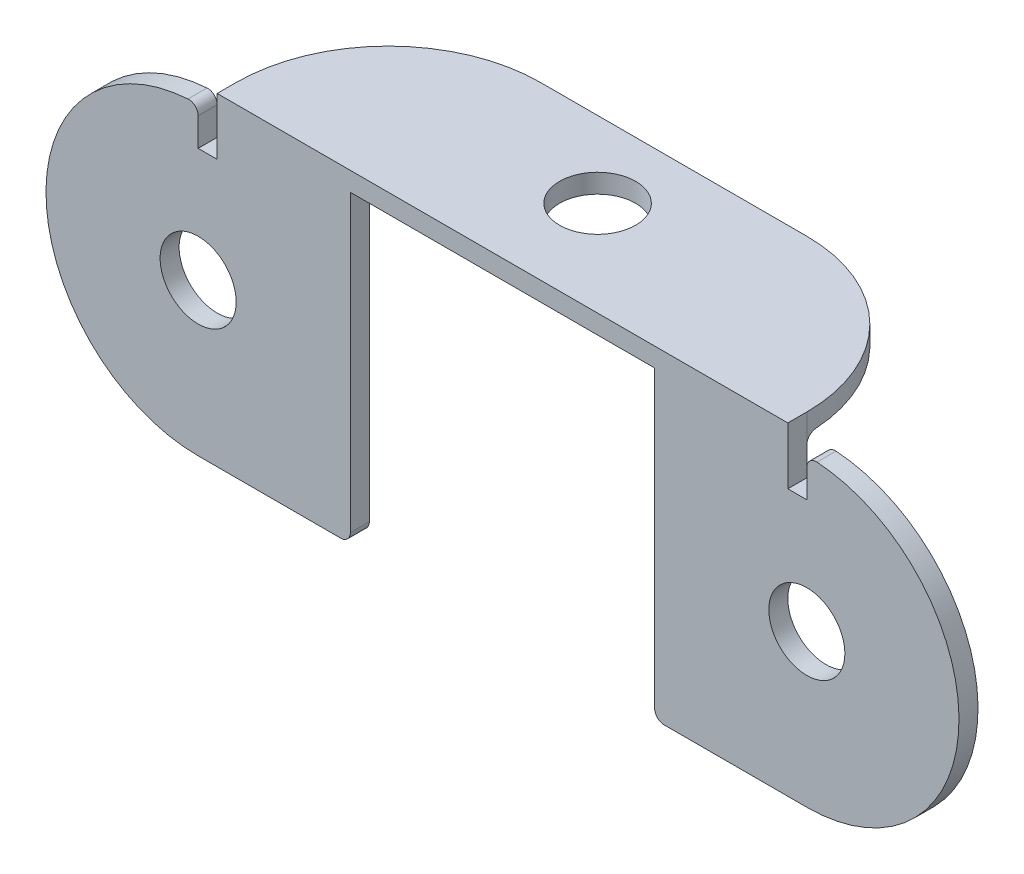
ISO-10303-21;
HEADER;
FILE_DESCRIPTION(('STEP AP214'),'2;1');
FILE_NAME('part.step','',(''),(''),'','','');
FILE_SCHEMA(('AUTOMOTIVE_DESIGN { 1 0 10303 214 1 1 1 1 }'));
ENDSEC;
DATA;
#1=APPLICATION_CONTEXT('core data for automotive mechanical design processes');
#2=APPLICATION_PROTOCOL_DEFINITION('international standard','automotive_design',2000,#1);
#3=PRODUCT_CONTEXT('',#1,'mechanical');
#4=PRODUCT('Part','Part','',(#3));
#5=PRODUCT_RELATED_PRODUCT_CATEGORY('part','',(#4));
#6=PRODUCT_DEFINITION_FORMATION('','',#4);
#7=PRODUCT_DEFINITION_CONTEXT('part definition',#1,'design');
#8=PRODUCT_DEFINITION('design','',#6,#7);
#9=PRODUCT_DEFINITION_SHAPE('','',#8);
#10=(LENGTH_UNIT() NAMED_UNIT(*) SI_UNIT(.MILLI.,.METRE.));
#11=(NAMED_UNIT(*) PLANE_ANGLE_UNIT() SI_UNIT($,.RADIAN.));
#12=(NAMED_UNIT(*) SI_UNIT($,.STERADIAN.) SOLID_ANGLE_UNIT());
#13=UNCERTAINTY_MEASURE_WITH_UNIT(LENGTH_MEASURE(1.E-05),#10,'distance_accuracy_value','');
#14=(GEOMETRIC_REPRESENTATION_CONTEXT(3) GLOBAL_UNCERTAINTY_ASSIGNED_CONTEXT((#13)) GLOBAL_UNIT_ASSIGNED_CONTEXT((#10,
#11,#12)) REPRESENTATION_CONTEXT('',''));
#15=CARTESIAN_POINT('',(0.,0.,0.));
#16=DIRECTION('',(0.,0.,1.));
#17=DIRECTION('',(1.,0.,0.));
#18=AXIS2_PLACEMENT_3D('',#15,#16,#17);
#19=CARTESIAN_POINT('',(0.,0.,0.));
#20=DIRECTION('',(0.,0.,1.));
#21=DIRECTION('',(1.,0.,0.));
#22=AXIS2_PLACEMENT_3D('',#19,#20,#21);
#23=PLANE('',#22);
#24=DIRECTION('',(0.,1.,0.));
#25=VECTOR('',#24,1.);
#26=CARTESIAN_POINT('',(-12.7,0.,0.));
#27=LINE('',#26,#25);
#28=CARTESIAN_POINT('',(-12.7,-11.90625,0.));
#29=VERTEX_POINT('',#28);
#30=CARTESIAN_POINT('',(-12.7,11.90625,0.));
#31=VERTEX_POINT('',#30);
#32=EDGE_CURVE('E281',#29,#31,#27,.T.);
#33=ORIENTED_EDGE('',*,*,#32,.F.);
#34=CARTESIAN_POINT('',(-13.49375,-11.90625,0.));
#35=DIRECTION('',(0.,0.,1.));
#36=DIRECTION('',(1.,0.,0.));
#37=AXIS2_PLACEMENT_3D('',#34,#35,#36);
#38=CIRCLE('',#37,0.79375);
#39=CARTESIAN_POINT('',(-13.49375,-12.7,0.));
#40=VERTEX_POINT('',#39);
#41=EDGE_CURVE('E355',#29,#40,#38,.F.);
#42=ORIENTED_EDGE('',*,*,#41,.T.);
#43=DIRECTION('',(1.,0.,0.));
#44=VECTOR('',#43,1.);
#45=CARTESIAN_POINT('',(0.,-12.7,0.));
#46=LINE('',#45,#44);
#47=CARTESIAN_POINT('',(-25.4,-12.7,0.));
#48=VERTEX_POINT('',#47);
#49=EDGE_CURVE('E277',#48,#40,#46,.T.);
#50=ORIENTED_EDGE('',*,*,#49,.F.);
#51=CARTESIAN_POINT('',(-25.4,0.,0.));
#52=DIRECTION('',(0.,0.,1.));
#53=DIRECTION('',(1.,0.,0.));
#54=AXIS2_PLACEMENT_3D('',#51,#52,#53);
#55=CIRCLE('',#54,12.7);
#56=CARTESIAN_POINT('',(-26.2466666666667,12.6717463498744,0.));
#57=VERTEX_POINT('',#56);
#58=EDGE_CURVE('E274',#57,#48,#55,.T.);
#59=ORIENTED_EDGE('',*,*,#58,.F.);
#60=CARTESIAN_POINT('',(-26.19375,11.8797622030073,0.));
#61=DIRECTION('',(0.,0.,1.));
#62=DIRECTION('',(1.,0.,0.));
#63=AXIS2_PLACEMENT_3D('',#60,#61,#62);
#64=CIRCLE('',#63,0.79375);
#65=CARTESIAN_POINT('',(-25.4,11.8797622030073,0.));
#66=VERTEX_POINT('',#65);
#67=EDGE_CURVE('E352',#57,#66,#64,.F.);
#68=ORIENTED_EDGE('',*,*,#67,.T.);
#69=DIRECTION('',(0.,-1.,0.));
#70=VECTOR('',#69,1.);
#71=CARTESIAN_POINT('',(-25.4,0.,0.));
#72=LINE('',#71,#70);
#73=CARTESIAN_POINT('',(-25.4,9.525,0.));
#74=VERTEX_POINT('',#73);
#75=EDGE_CURVE('E539',#66,#74,#72,.T.);
#76=ORIENTED_EDGE('',*,*,#75,.T.);
#77=DIRECTION('',(1.,0.,0.));
#78=VECTOR('',#77,1.);
#79=CARTESIAN_POINT('',(0.,9.525,0.));
#80=LINE('',#79,#78);
#81=CARTESIAN_POINT('',(-23.8125,9.525,0.));
#82=VERTEX_POINT('',#81);
#83=EDGE_CURVE('E550',#74,#82,#80,.T.);
#84=ORIENTED_EDGE('',*,*,#83,.T.);
#85=DIRECTION('',(0.,1.,0.));
#86=VECTOR('',#85,1.);
#87=CARTESIAN_POINT('',(-23.8125,0.,0.));
#88=LINE('',#87,#86);
#89=CARTESIAN_POINT('',(-23.8125,11.90625,0.));
#90=VERTEX_POINT('',#89);
#91=EDGE_CURVE('E552',#82,#90,#88,.T.);
#92=ORIENTED_EDGE('',*,*,#91,.T.);
#93=DIRECTION('',(1.,0.,0.));
#94=VECTOR('',#93,1.);
#95=CARTESIAN_POINT('',(-12.7,11.90625,0.));
#96=LINE('',#95,#94);
#97=EDGE_CURVE('E348',#90,#31,#96,.T.);
#98=ORIENTED_EDGE('',*,*,#97,.T.);
#99=EDGE_LOOP('',(#33,#42,#50,#59,#68,#76,#84,#92,#98));
#100=FACE_BOUND('',#99,.T.);
#101=CARTESIAN_POINT('',(-25.4,0.,0.));
#102=DIRECTION('',(0.,0.,1.));
#103=DIRECTION('',(1.,0.,0.));
#104=AXIS2_PLACEMENT_3D('',#101,#102,#103);
#105=CIRCLE('',#104,3.175);
#106=CARTESIAN_POINT('',(-22.225,0.,0.));
#107=VERTEX_POINT('',#106);
#108=EDGE_CURVE('E285',#107,#107,#105,.T.);
#109=ORIENTED_EDGE('',*,*,#108,.T.);
#110=EDGE_LOOP('',(#109));
#111=FACE_BOUND('',#110,.T.);
#112=ADVANCED_FACE('F41',(#100,#111),#23,.F.);
#113=CARTESIAN_POINT('',(12.7,0.,1.5875));
#114=DIRECTION('',(-1.,0.,0.));
#115=DIRECTION('',(0.,0.,1.));
#116=AXIS2_PLACEMENT_3D('',#113,#114,#115);
#117=PLANE('',#116);
#118=DIRECTION('',(0.,1.,0.));
#119=VECTOR('',#118,1.);
#120=CARTESIAN_POINT('',(12.7,0.,0.));
#121=LINE('',#120,#119);
#122=CARTESIAN_POINT('',(12.7,-11.90625,0.));
#123=VERTEX_POINT('',#122);
#124=CARTESIAN_POINT('',(12.7,11.90625,0.));
#125=VERTEX_POINT('',#124);
#126=EDGE_CURVE('E262',#123,#125,#121,.T.);
#127=ORIENTED_EDGE('',*,*,#126,.F.);
#128=DIRECTION('',(0.,0.,-1.));
#129=VECTOR('',#128,1.);
#130=CARTESIAN_POINT('',(12.7,-11.90625,1.5875));
#131=LINE('',#130,#129);
#132=CARTESIAN_POINT('',(12.7,-11.90625,1.5875));
#133=VERTEX_POINT('',#132);
#134=EDGE_CURVE('E329',#123,#133,#131,.F.);
#135=ORIENTED_EDGE('',*,*,#134,.T.);
#136=DIRECTION('',(0.,1.,0.));
#137=VECTOR('',#136,1.);
#138=CARTESIAN_POINT('',(12.7,0.,1.5875));
#139=LINE('',#138,#137);
#140=CARTESIAN_POINT('',(12.7,12.7,1.5875));
#141=VERTEX_POINT('',#140);
#142=EDGE_CURVE('E293',#133,#141,#139,.T.);
#143=ORIENTED_EDGE('',*,*,#142,.T.);
#144=DIRECTION('',(0.,0.,-1.));
#145=VECTOR('',#144,1.);
#146=CARTESIAN_POINT('',(12.7,12.7,1.5875));
#147=LINE('',#146,#145);
#148=CARTESIAN_POINT('',(12.7,12.7,-0.79375));
#149=VERTEX_POINT('',#148);
#150=EDGE_CURVE('E261',#141,#149,#147,.T.);
#151=ORIENTED_EDGE('',*,*,#150,.T.);
#152=CARTESIAN_POINT('',(12.7,11.90625,-0.79375));
#153=DIRECTION('',(-1.,0.,0.));
#154=DIRECTION('',(0.,0.,1.));
#155=AXIS2_PLACEMENT_3D('',#152,#153,#154);
#156=CIRCLE('',#155,0.79375);
#157=EDGE_CURVE('E386',#149,#125,#156,.F.);
#158=ORIENTED_EDGE('',*,*,#157,.T.);
#159=EDGE_LOOP('',(#127,#135,#143,#151,#158));
#160=FACE_BOUND('',#159,.T.);
#161=ADVANCED_FACE('F439',(#160),#117,.T.);
#162=CARTESIAN_POINT('',(0.,-12.7,1.5875));
#163=DIRECTION('',(0.,1.,0.));
#164=DIRECTION('',(-1.,0.,0.));
#165=AXIS2_PLACEMENT_3D('',#162,#163,#164);
#166=PLANE('',#165);
#167=DIRECTION('',(1.,0.,0.));
#168=VECTOR('',#167,1.);
#169=CARTESIAN_POINT('',(0.,-12.7,1.5875));
#170=LINE('',#169,#168);
#171=CARTESIAN_POINT('',(13.49375,-12.7,1.5875));
#172=VERTEX_POINT('',#171);
#173=CARTESIAN_POINT('',(25.4,-12.7,1.5875));
#174=VERTEX_POINT('',#173);
#175=EDGE_CURVE('E239',#172,#174,#170,.T.);
#176=ORIENTED_EDGE('',*,*,#175,.F.);
#177=DIRECTION('',(0.,0.,-1.));
#178=VECTOR('',#177,1.);
#179=CARTESIAN_POINT('',(13.49375,-12.7,0.));
#180=LINE('',#179,#178);
#181=CARTESIAN_POINT('',(13.49375,-12.7,0.));
#182=VERTEX_POINT('',#181);
#183=EDGE_CURVE('E315',#172,#182,#180,.T.);
#184=ORIENTED_EDGE('',*,*,#183,.T.);
#185=DIRECTION('',(1.,0.,0.));
#186=VECTOR('',#185,1.);
#187=CARTESIAN_POINT('',(0.,-12.7,0.));
#188=LINE('',#187,#186);
#189=CARTESIAN_POINT('',(25.4,-12.7,0.));
#190=VERTEX_POINT('',#189);
#191=EDGE_CURVE('E266',#182,#190,#188,.T.);
#192=ORIENTED_EDGE('',*,*,#191,.T.);
#193=DIRECTION('',(0.,0.,-1.));
#194=VECTOR('',#193,1.);
#195=CARTESIAN_POINT('',(25.4,-12.7,1.5875));
#196=LINE('',#195,#194);
#197=EDGE_CURVE('E304',#174,#190,#196,.T.);
#198=ORIENTED_EDGE('',*,*,#197,.F.);
#199=EDGE_LOOP('',(#176,#184,#192,#198));
#200=FACE_BOUND('',#199,.T.);
#201=ADVANCED_FACE('F442',(#200),#166,.F.);
#202=CARTESIAN_POINT('',(25.4,0.,1.5875));
#203=DIRECTION('',(0.,0.,-1.));
#204=DIRECTION('',(-1.,0.,0.));
#205=AXIS2_PLACEMENT_3D('',#202,#203,#204);
#206=CYLINDRICAL_SURFACE('',#205,12.7);
#207=CARTESIAN_POINT('',(25.4,0.,0.));
#208=DIRECTION('',(0.,0.,1.));
#209=DIRECTION('',(1.,0.,0.));
#210=AXIS2_PLACEMENT_3D('',#207,#208,#209);
#211=CIRCLE('',#210,12.7);
#212=CARTESIAN_POINT('',(26.2466666666667,12.6717463498744,0.));
#213=VERTEX_POINT('',#212);
#214=EDGE_CURVE('E270',#190,#213,#211,.T.);
#215=ORIENTED_EDGE('',*,*,#214,.T.);
#216=DIRECTION('',(0.,0.,-1.));
#217=VECTOR('',#216,1.);
#218=CARTESIAN_POINT('',(26.2466666666667,12.6717463498744,1.5875));
#219=LINE('',#218,#217);
#220=CARTESIAN_POINT('',(26.2466666666667,12.6717463498744,1.5875));
#221=VERTEX_POINT('',#220);
#222=EDGE_CURVE('E365',#213,#221,#219,.F.);
#223=ORIENTED_EDGE('',*,*,#222,.T.);
#224=CARTESIAN_POINT('',(25.4,0.,1.5875));
#225=DIRECTION('',(0.,0.,1.));
#226=DIRECTION('',(1.,0.,0.));
#227=AXIS2_PLACEMENT_3D('',#224,#225,#226);
#228=CIRCLE('',#227,12.7);
#229=EDGE_CURVE('E232',#174,#221,#228,.T.);
#230=ORIENTED_EDGE('',*,*,#229,.F.);
#231=ORIENTED_EDGE('',*,*,#197,.T.);
#232=EDGE_LOOP('',(#215,#223,#230,#231));
#233=FACE_BOUND('',#232,.T.);
#234=ADVANCED_FACE('F446',(#233),#206,.T.);
#235=CARTESIAN_POINT('',(0.,14.2875,1.5875));
#236=DIRECTION('',(0.,1.,0.));
#237=DIRECTION('',(0.,0.,1.));
#238=AXIS2_PLACEMENT_3D('',#235,#236,#237);
#239=PLANE('',#238);
#240=DIRECTION('',(0.,0.,1.));
#241=VECTOR('',#240,1.);
#242=CARTESIAN_POINT('',(23.8125,14.2875,-12.7));
#243=LINE('',#242,#241);
#244=CARTESIAN_POINT('',(23.8125,14.2875,0.));
#245=VERTEX_POINT('',#244);
#246=CARTESIAN_POINT('',(23.8125,14.2875,1.5875));
#247=VERTEX_POINT('',#246);
#248=EDGE_CURVE('E201',#245,#247,#243,.T.);
#249=ORIENTED_EDGE('',*,*,#248,.F.);
#250=CARTESIAN_POINT('',(11.1125,14.2875,0.));
#251=DIRECTION('',(0.,1.,0.));
#252=DIRECTION('',(0.,0.,1.));
#253=AXIS2_PLACEMENT_3D('',#250,#251,#252);
#254=CIRCLE('',#253,12.7);
#255=CARTESIAN_POINT('',(11.1125,14.2875,-12.7));
#256=VERTEX_POINT('',#255);
#257=EDGE_CURVE('E610',#245,#256,#254,.T.);
#258=ORIENTED_EDGE('',*,*,#257,.T.);
#259=DIRECTION('',(-1.,0.,0.));
#260=VECTOR('',#259,1.);
#261=CARTESIAN_POINT('',(-25.4,14.2875,-12.7));
#262=LINE('',#261,#260);
#263=CARTESIAN_POINT('',(-11.1125,14.2875,-12.7));
#264=VERTEX_POINT('',#263);
#265=EDGE_CURVE('E563',#256,#264,#262,.T.);
#266=ORIENTED_EDGE('',*,*,#265,.T.);
#267=CARTESIAN_POINT('',(-11.1125,14.2875,0.));
#268=DIRECTION('',(0.,1.,0.));
#269=DIRECTION('',(0.,0.,1.));
#270=AXIS2_PLACEMENT_3D('',#267,#268,#269);
#271=CIRCLE('',#270,12.7);
#272=CARTESIAN_POINT('',(-23.8125,14.2875,0.));
#273=VERTEX_POINT('',#272);
#274=EDGE_CURVE('E63',#264,#273,#271,.T.);
#275=ORIENTED_EDGE('',*,*,#274,.T.);
#276=DIRECTION('',(0.,0.,1.));
#277=VECTOR('',#276,1.);
#278=CARTESIAN_POINT('',(-23.8125,14.2875,-12.7));
#279=LINE('',#278,#277);
#280=CARTESIAN_POINT('',(-23.8125,14.2875,1.5875));
#281=VERTEX_POINT('',#280);
#282=EDGE_CURVE('E228',#273,#281,#279,.T.);
#283=ORIENTED_EDGE('',*,*,#282,.T.);
#284=DIRECTION('',(1.,0.,0.));
#285=VECTOR('',#284,1.);
#286=CARTESIAN_POINT('',(0.,14.2875,1.5875));
#287=LINE('',#286,#285);
#288=EDGE_CURVE('E219',#281,#247,#287,.T.);
#289=ORIENTED_EDGE('',*,*,#288,.T.);
#290=EDGE_LOOP('',(#249,#258,#266,#275,#283,#289));
#291=FACE_BOUND('',#290,.T.);
#292=CARTESIAN_POINT('',(0.,14.2875,-6.35));
#293=DIRECTION('',(0.,1.,0.));
#294=DIRECTION('',(0.,0.,1.));
#295=AXIS2_PLACEMENT_3D('',#292,#293,#294);
#296=CIRCLE('',#295,3.175);
#297=CARTESIAN_POINT('',(0.,14.2875,-3.175));
#298=VERTEX_POINT('',#297);
#299=EDGE_CURVE('E558',#298,#298,#296,.T.);
#300=ORIENTED_EDGE('',*,*,#299,.F.);
#301=EDGE_LOOP('',(#300));
#302=FACE_BOUND('',#301,.T.);
#303=ADVANCED_FACE('F226',(#291,#302),#239,.T.);
#304=CARTESIAN_POINT('',(-25.4,0.,1.5875));
#305=DIRECTION('',(0.,0.,-1.));
#306=DIRECTION('',(-1.,0.,0.));
#307=AXIS2_PLACEMENT_3D('',#304,#305,#306);
#308=CYLINDRICAL_SURFACE('',#307,12.7);
#309=CARTESIAN_POINT('',(-25.4,0.,1.5875));
#310=DIRECTION('',(0.,0.,1.));
#311=DIRECTION('',(1.,0.,0.));
#312=AXIS2_PLACEMENT_3D('',#309,#310,#311);
#313=CIRCLE('',#312,12.7);
#314=CARTESIAN_POINT('',(-26.2466666666667,12.6717463498744,1.5875));
#315=VERTEX_POINT('',#314);
#316=CARTESIAN_POINT('',(-25.4,-12.7,1.5875));
#317=VERTEX_POINT('',#316);
#318=EDGE_CURVE('E231',#315,#317,#313,.T.);
#319=ORIENTED_EDGE('',*,*,#318,.F.);
#320=DIRECTION('',(0.,0.,-1.));
#321=VECTOR('',#320,1.);
#322=CARTESIAN_POINT('',(-26.2466666666667,12.6717463498744,1.5875));
#323=LINE('',#322,#321);
#324=EDGE_CURVE('E368',#315,#57,#323,.T.);
#325=ORIENTED_EDGE('',*,*,#324,.T.);
#326=ORIENTED_EDGE('',*,*,#58,.T.);
#327=DIRECTION('',(0.,0.,-1.));
#328=VECTOR('',#327,1.);
#329=CARTESIAN_POINT('',(-25.4,-12.7,1.5875));
#330=LINE('',#329,#328);
#331=EDGE_CURVE('E300',#317,#48,#330,.T.);
#332=ORIENTED_EDGE('',*,*,#331,.F.);
#333=EDGE_LOOP('',(#319,#325,#326,#332));
#334=FACE_BOUND('',#333,.T.);
#335=ADVANCED_FACE('F453',(#334),#308,.T.);
#336=CARTESIAN_POINT('',(0.,-12.7,1.5875));
#337=DIRECTION('',(0.,1.,0.));
#338=DIRECTION('',(0.,0.,1.));
#339=AXIS2_PLACEMENT_3D('',#336,#337,#338);
#340=PLANE('',#339);
#341=ORIENTED_EDGE('',*,*,#49,.T.);
#342=DIRECTION('',(0.,0.,-1.));
#343=VECTOR('',#342,1.);
#344=CARTESIAN_POINT('',(-13.49375,-12.7,1.5875));
#345=LINE('',#344,#343);
#346=CARTESIAN_POINT('',(-13.49375,-12.7,1.5875));
#347=VERTEX_POINT('',#346);
#348=EDGE_CURVE('E358',#40,#347,#345,.F.);
#349=ORIENTED_EDGE('',*,*,#348,.T.);
#350=DIRECTION('',(1.,0.,0.));
#351=VECTOR('',#350,1.);
#352=CARTESIAN_POINT('',(0.,-12.7,1.5875));
#353=LINE('',#352,#351);
#354=EDGE_CURVE('E236',#317,#347,#353,.T.);
#355=ORIENTED_EDGE('',*,*,#354,.F.);
#356=ORIENTED_EDGE('',*,*,#331,.T.);
#357=EDGE_LOOP('',(#341,#349,#355,#356));
#358=FACE_BOUND('',#357,.T.);
#359=ADVANCED_FACE('F456',(#358),#340,.F.);
#360=CARTESIAN_POINT('',(-12.7,0.,1.5875));
#361=DIRECTION('',(-1.,0.,0.));
#362=DIRECTION('',(0.,0.,1.));
#363=AXIS2_PLACEMENT_3D('',#360,#361,#362);
#364=PLANE('',#363);
#365=DIRECTION('',(0.,1.,0.));
#366=VECTOR('',#365,1.);
#367=CARTESIAN_POINT('',(-12.7,0.,1.5875));
#368=LINE('',#367,#366);
#369=CARTESIAN_POINT('',(-12.7,-11.90625,1.5875));
#370=VERTEX_POINT('',#369);
#371=CARTESIAN_POINT('',(-12.7,12.7,1.5875));
#372=VERTEX_POINT('',#371);
#373=EDGE_CURVE('E246',#370,#372,#368,.T.);
#374=ORIENTED_EDGE('',*,*,#373,.F.);
#375=DIRECTION('',(0.,0.,-1.));
#376=VECTOR('',#375,1.);
#377=CARTESIAN_POINT('',(-12.7,-11.90625,1.5875));
#378=LINE('',#377,#376);
#379=EDGE_CURVE('E344',#370,#29,#378,.T.);
#380=ORIENTED_EDGE('',*,*,#379,.T.);
#381=ORIENTED_EDGE('',*,*,#32,.T.);
#382=CARTESIAN_POINT('',(-12.7,11.90625,-0.79375));
#383=DIRECTION('',(-1.,0.,0.));
#384=DIRECTION('',(0.,0.,1.));
#385=AXIS2_PLACEMENT_3D('',#382,#383,#384);
#386=CIRCLE('',#385,0.79375);
#387=CARTESIAN_POINT('',(-12.7,12.7,-0.79375));
#388=VERTEX_POINT('',#387);
#389=EDGE_CURVE('E382',#31,#388,#386,.T.);
#390=ORIENTED_EDGE('',*,*,#389,.T.);
#391=DIRECTION('',(0.,0.,-1.));
#392=VECTOR('',#391,1.);
#393=CARTESIAN_POINT('',(-12.7,12.7,1.5875));
#394=LINE('',#393,#392);
#395=EDGE_CURVE('E297',#372,#388,#394,.T.);
#396=ORIENTED_EDGE('',*,*,#395,.F.);
#397=EDGE_LOOP('',(#374,#380,#381,#390,#396));
#398=FACE_BOUND('',#397,.T.);
#399=ADVANCED_FACE('F460',(#398),#364,.F.);
#400=CARTESIAN_POINT('',(-25.4,0.,1.5875));
#401=DIRECTION('',(0.,0.,-1.));
#402=DIRECTION('',(-1.,0.,0.));
#403=AXIS2_PLACEMENT_3D('',#400,#401,#402);
#404=CYLINDRICAL_SURFACE('',#403,3.175);
#405=CARTESIAN_POINT('',(-25.4,0.,1.5875));
#406=DIRECTION('',(0.,0.,1.));
#407=DIRECTION('',(1.,0.,0.));
#408=AXIS2_PLACEMENT_3D('',#405,#406,#407);
#409=CIRCLE('',#408,3.175);
#410=CARTESIAN_POINT('',(-22.225,0.,1.5875));
#411=VERTEX_POINT('',#410);
#412=EDGE_CURVE('E253',#411,#411,#409,.T.);
#413=ORIENTED_EDGE('',*,*,#412,.T.);
#414=EDGE_LOOP('',(#413));
#415=FACE_BOUND('',#414,.T.);
#416=ORIENTED_EDGE('',*,*,#108,.F.);
#417=EDGE_LOOP('',(#416));
#418=FACE_BOUND('',#417,.T.);
#419=ADVANCED_FACE('F464',(#415,#418),#404,.F.);
#420=CARTESIAN_POINT('',(0.,12.7,1.5875));
#421=DIRECTION('',(0.,1.,0.));
#422=DIRECTION('',(0.,0.,1.));
#423=AXIS2_PLACEMENT_3D('',#420,#421,#422);
#424=PLANE('',#423);
#425=DIRECTION('',(-1.,0.,0.));
#426=VECTOR('',#425,1.);
#427=CARTESIAN_POINT('',(-25.4,12.7,-12.7));
#428=LINE('',#427,#426);
#429=CARTESIAN_POINT('',(11.1125,12.7,-12.7));
#430=VERTEX_POINT('',#429);
#431=CARTESIAN_POINT('',(-11.1125,12.7,-12.7));
#432=VERTEX_POINT('',#431);
#433=EDGE_CURVE('E267',#430,#432,#428,.T.);
#434=ORIENTED_EDGE('',*,*,#433,.F.);
#435=CARTESIAN_POINT('',(11.1125,12.7,0.));
#436=DIRECTION('',(0.,1.,0.));
#437=DIRECTION('',(0.,0.,1.));
#438=AXIS2_PLACEMENT_3D('',#435,#436,#437);
#439=CIRCLE('',#438,12.7);
#440=CARTESIAN_POINT('',(23.7876710417454,12.7,-0.79375));
#441=VERTEX_POINT('',#440);
#442=EDGE_CURVE('E399',#430,#441,#439,.F.);
#443=ORIENTED_EDGE('',*,*,#442,.T.);
#444=DIRECTION('',(1.,0.,0.));
#445=VECTOR('',#444,1.);
#446=CARTESIAN_POINT('',(12.7,12.7,-0.79375));
#447=LINE('',#446,#445);
#448=EDGE_CURVE('E375',#441,#149,#447,.F.);
#449=ORIENTED_EDGE('',*,*,#448,.T.);
#450=ORIENTED_EDGE('',*,*,#150,.F.);
#451=DIRECTION('',(1.,0.,0.));
#452=VECTOR('',#451,1.);
#453=CARTESIAN_POINT('',(0.,12.7,1.5875));
#454=LINE('',#453,#452);
#455=EDGE_CURVE('E249',#372,#141,#454,.T.);
#456=ORIENTED_EDGE('',*,*,#455,.F.);
#457=ORIENTED_EDGE('',*,*,#395,.T.);
#458=DIRECTION('',(1.,0.,0.));
#459=VECTOR('',#458,1.);
#460=CARTESIAN_POINT('',(-23.8125,12.7,-0.79375));
#461=LINE('',#460,#459);
#462=CARTESIAN_POINT('',(-23.7876710417454,12.7,-0.79375));
#463=VERTEX_POINT('',#462);
#464=EDGE_CURVE('E378',#388,#463,#461,.F.);
#465=ORIENTED_EDGE('',*,*,#464,.T.);
#466=CARTESIAN_POINT('',(-11.1125,12.7,0.));
#467=DIRECTION('',(0.,1.,0.));
#468=DIRECTION('',(0.,0.,1.));
#469=AXIS2_PLACEMENT_3D('',#466,#467,#468);
#470=CIRCLE('',#469,12.7);
#471=EDGE_CURVE('E396',#463,#432,#470,.F.);
#472=ORIENTED_EDGE('',*,*,#471,.T.);
#473=EDGE_LOOP('',(#434,#443,#449,#450,#456,#457,#465,#472));
#474=FACE_BOUND('',#473,.T.);
#475=CARTESIAN_POINT('',(0.,12.7,-6.35));
#476=DIRECTION('',(0.,1.,0.));
#477=DIRECTION('',(0.,0.,1.));
#478=AXIS2_PLACEMENT_3D('',#475,#476,#477);
#479=CIRCLE('',#478,3.175);
#480=CARTESIAN_POINT('',(0.,12.7,-3.175));
#481=VERTEX_POINT('',#480);
#482=EDGE_CURVE('E559',#481,#481,#479,.T.);
#483=ORIENTED_EDGE('',*,*,#482,.T.);
#484=EDGE_LOOP('',(#483));
#485=FACE_BOUND('',#484,.T.);
#486=ADVANCED_FACE('F466',(#474,#485),#424,.F.);
#487=CARTESIAN_POINT('',(25.4,0.,1.5875));
#488=DIRECTION('',(0.,0.,-1.));
#489=DIRECTION('',(-1.,0.,0.));
#490=AXIS2_PLACEMENT_3D('',#487,#488,#489);
#491=CYLINDRICAL_SURFACE('',#490,3.175);
#492=CARTESIAN_POINT('',(25.4,0.,1.5875));
#493=DIRECTION('',(0.,0.,1.));
#494=DIRECTION('',(1.,0.,0.));
#495=AXIS2_PLACEMENT_3D('',#492,#493,#494);
#496=CIRCLE('',#495,3.175);
#497=CARTESIAN_POINT('',(28.575,0.,1.5875));
#498=VERTEX_POINT('',#497);
#499=EDGE_CURVE('E257',#498,#498,#496,.T.);
#500=ORIENTED_EDGE('',*,*,#499,.T.);
#501=EDGE_LOOP('',(#500));
#502=FACE_BOUND('',#501,.T.);
#503=CARTESIAN_POINT('',(25.4,0.,0.));
#504=DIRECTION('',(0.,0.,1.));
#505=DIRECTION('',(1.,0.,0.));
#506=AXIS2_PLACEMENT_3D('',#503,#504,#505);
#507=CIRCLE('',#506,3.175);
#508=CARTESIAN_POINT('',(28.575,0.,0.));
#509=VERTEX_POINT('',#508);
#510=EDGE_CURVE('E289',#509,#509,#507,.T.);
#511=ORIENTED_EDGE('',*,*,#510,.F.);
#512=EDGE_LOOP('',(#511));
#513=FACE_BOUND('',#512,.T.);
#514=ADVANCED_FACE('F469',(#502,#513),#491,.F.);
#515=CARTESIAN_POINT('',(0.,0.,1.5875));
#516=DIRECTION('',(0.,0.,1.));
#517=DIRECTION('',(1.,0.,0.));
#518=AXIS2_PLACEMENT_3D('',#515,#516,#517);
#519=PLANE('',#518);
#520=ORIENTED_EDGE('',*,*,#142,.F.);
#521=CARTESIAN_POINT('',(13.49375,-11.90625,1.5875));
#522=DIRECTION('',(0.,0.,1.));
#523=DIRECTION('',(1.,0.,0.));
#524=AXIS2_PLACEMENT_3D('',#521,#522,#523);
#525=CIRCLE('',#524,0.79375);
#526=EDGE_CURVE('E341',#133,#172,#525,.T.);
#527=ORIENTED_EDGE('',*,*,#526,.T.);
#528=ORIENTED_EDGE('',*,*,#175,.T.);
#529=ORIENTED_EDGE('',*,*,#229,.T.);
#530=CARTESIAN_POINT('',(26.19375,11.8797622030073,1.5875));
#531=DIRECTION('',(0.,0.,1.));
#532=DIRECTION('',(1.,0.,0.));
#533=AXIS2_PLACEMENT_3D('',#530,#531,#532);
#534=CIRCLE('',#533,0.79375);
#535=CARTESIAN_POINT('',(25.4,11.8797622030073,1.5875));
#536=VERTEX_POINT('',#535);
#537=EDGE_CURVE('E335',#221,#536,#534,.T.);
#538=ORIENTED_EDGE('',*,*,#537,.T.);
#539=DIRECTION('',(0.,1.,0.));
#540=VECTOR('',#539,1.);
#541=CARTESIAN_POINT('',(25.4,0.,1.5875));
#542=LINE('',#541,#540);
#543=CARTESIAN_POINT('',(25.4,9.525,1.5875));
#544=VERTEX_POINT('',#543);
#545=EDGE_CURVE('E585',#544,#536,#542,.T.);
#546=ORIENTED_EDGE('',*,*,#545,.F.);
#547=DIRECTION('',(1.,0.,0.));
#548=VECTOR('',#547,1.);
#549=CARTESIAN_POINT('',(0.,9.525,1.5875));
#550=LINE('',#549,#548);
#551=CARTESIAN_POINT('',(23.8125,9.525,1.5875));
#552=VERTEX_POINT('',#551);
#553=EDGE_CURVE('E221',#552,#544,#550,.T.);
#554=ORIENTED_EDGE('',*,*,#553,.F.);
#555=DIRECTION('',(0.,-1.,0.));
#556=VECTOR('',#555,1.);
#557=CARTESIAN_POINT('',(23.8125,0.,1.5875));
#558=LINE('',#557,#556);
#559=EDGE_CURVE('E205',#247,#552,#558,.T.);
#560=ORIENTED_EDGE('',*,*,#559,.F.);
#561=ORIENTED_EDGE('',*,*,#288,.F.);
#562=DIRECTION('',(0.,1.,0.));
#563=VECTOR('',#562,1.);
#564=CARTESIAN_POINT('',(-23.8125,0.,1.5875));
#565=LINE('',#564,#563);
#566=CARTESIAN_POINT('',(-23.8125,9.525,1.5875));
#567=VERTEX_POINT('',#566);
#568=EDGE_CURVE('E591',#567,#281,#565,.T.);
#569=ORIENTED_EDGE('',*,*,#568,.F.);
#570=DIRECTION('',(1.,0.,0.));
#571=VECTOR('',#570,1.);
#572=CARTESIAN_POINT('',(0.,9.525,1.5875));
#573=LINE('',#572,#571);
#574=CARTESIAN_POINT('',(-25.4,9.525,1.5875));
#575=VERTEX_POINT('',#574);
#576=EDGE_CURVE('E312',#575,#567,#573,.T.);
#577=ORIENTED_EDGE('',*,*,#576,.F.);
#578=DIRECTION('',(0.,-1.,0.));
#579=VECTOR('',#578,1.);
#580=CARTESIAN_POINT('',(-25.4,0.,1.5875));
#581=LINE('',#580,#579);
#582=CARTESIAN_POINT('',(-25.4,11.8797622030073,1.5875));
#583=VERTEX_POINT('',#582);
#584=EDGE_CURVE('E546',#583,#575,#581,.T.);
#585=ORIENTED_EDGE('',*,*,#584,.F.);
#586=CARTESIAN_POINT('',(-26.19375,11.8797622030073,1.5875));
#587=DIRECTION('',(0.,0.,1.));
#588=DIRECTION('',(1.,0.,0.));
#589=AXIS2_PLACEMENT_3D('',#586,#587,#588);
#590=CIRCLE('',#589,0.79375);
#591=EDGE_CURVE('E332',#583,#315,#590,.T.);
#592=ORIENTED_EDGE('',*,*,#591,.T.);
#593=ORIENTED_EDGE('',*,*,#318,.T.);
#594=ORIENTED_EDGE('',*,*,#354,.T.);
#595=CARTESIAN_POINT('',(-13.49375,-11.90625,1.5875));
#596=DIRECTION('',(0.,0.,1.));
#597=DIRECTION('',(1.,0.,0.));
#598=AXIS2_PLACEMENT_3D('',#595,#596,#597);
#599=CIRCLE('',#598,0.79375);
#600=EDGE_CURVE('E338',#347,#370,#599,.T.);
#601=ORIENTED_EDGE('',*,*,#600,.T.);
#602=ORIENTED_EDGE('',*,*,#373,.T.);
#603=ORIENTED_EDGE('',*,*,#455,.T.);
#604=EDGE_LOOP('',(#520,#527,#528,#529,#538,#546,#554,#560,#561,#569,#577,#585,#592,#593,#594,
#601,#602,#603));
#605=FACE_BOUND('',#604,.T.);
#606=ORIENTED_EDGE('',*,*,#412,.F.);
#607=EDGE_LOOP('',(#606));
#608=FACE_BOUND('',#607,.T.);
#609=ORIENTED_EDGE('',*,*,#499,.F.);
#610=EDGE_LOOP('',(#609));
#611=FACE_BOUND('',#610,.T.);
#612=ADVANCED_FACE('F216',(#605,#608,#611),#519,.T.);
#613=ORIENTED_EDGE('',*,*,#191,.F.);
#614=CARTESIAN_POINT('',(13.49375,-11.90625,0.));
#615=DIRECTION('',(0.,0.,1.));
#616=DIRECTION('',(1.,0.,0.));
#617=AXIS2_PLACEMENT_3D('',#614,#615,#616);
#618=CIRCLE('',#617,0.79375);
#619=EDGE_CURVE('E326',#182,#123,#618,.F.);
#620=ORIENTED_EDGE('',*,*,#619,.T.);
#621=ORIENTED_EDGE('',*,*,#126,.T.);
#622=DIRECTION('',(1.,0.,0.));
#623=VECTOR('',#622,1.);
#624=CARTESIAN_POINT('',(23.8125,11.90625,0.));
#625=LINE('',#624,#623);
#626=CARTESIAN_POINT('',(23.8125,11.90625,0.));
#627=VERTEX_POINT('',#626);
#628=EDGE_CURVE('E319',#125,#627,#625,.T.);
#629=ORIENTED_EDGE('',*,*,#628,.T.);
#630=DIRECTION('',(0.,-1.,0.));
#631=VECTOR('',#630,1.);
#632=CARTESIAN_POINT('',(23.8125,0.,0.));
#633=LINE('',#632,#631);
#634=CARTESIAN_POINT('',(23.8125,9.525,0.));
#635=VERTEX_POINT('',#634);
#636=EDGE_CURVE('E224',#627,#635,#633,.T.);
#637=ORIENTED_EDGE('',*,*,#636,.T.);
#638=DIRECTION('',(1.,0.,0.));
#639=VECTOR('',#638,1.);
#640=CARTESIAN_POINT('',(0.,9.525,0.));
#641=LINE('',#640,#639);
#642=CARTESIAN_POINT('',(25.4,9.525,0.));
#643=VERTEX_POINT('',#642);
#644=EDGE_CURVE('E308',#635,#643,#641,.T.);
#645=ORIENTED_EDGE('',*,*,#644,.T.);
#646=DIRECTION('',(0.,1.,0.));
#647=VECTOR('',#646,1.);
#648=CARTESIAN_POINT('',(25.4,0.,0.));
#649=LINE('',#648,#647);
#650=CARTESIAN_POINT('',(25.4,11.8797622030073,0.));
#651=VERTEX_POINT('',#650);
#652=EDGE_CURVE('E223',#643,#651,#649,.T.);
#653=ORIENTED_EDGE('',*,*,#652,.T.);
#654=CARTESIAN_POINT('',(26.19375,11.8797622030073,0.));
#655=DIRECTION('',(0.,0.,1.));
#656=DIRECTION('',(1.,0.,0.));
#657=AXIS2_PLACEMENT_3D('',#654,#655,#656);
#658=CIRCLE('',#657,0.79375);
#659=EDGE_CURVE('E323',#651,#213,#658,.F.);
#660=ORIENTED_EDGE('',*,*,#659,.T.);
#661=ORIENTED_EDGE('',*,*,#214,.F.);
#662=EDGE_LOOP('',(#613,#620,#621,#629,#637,#645,#653,#660,#661));
#663=FACE_BOUND('',#662,.T.);
#664=ORIENTED_EDGE('',*,*,#510,.T.);
#665=EDGE_LOOP('',(#664));
#666=FACE_BOUND('',#665,.T.);
#667=ADVANCED_FACE('F477',(#663,#666),#23,.F.);
#668=CARTESIAN_POINT('',(-25.4,12.7,-12.7));
#669=DIRECTION('',(0.,0.,-1.));
#670=DIRECTION('',(-1.,0.,0.));
#671=AXIS2_PLACEMENT_3D('',#668,#669,#670);
#672=PLANE('',#671);
#673=ORIENTED_EDGE('',*,*,#265,.F.);
#674=DIRECTION('',(0.,-1.,0.));
#675=VECTOR('',#674,1.);
#676=CARTESIAN_POINT('',(11.1125,12.7,-12.7));
#677=LINE('',#676,#675);
#678=EDGE_CURVE('E392',#256,#430,#677,.T.);
#679=ORIENTED_EDGE('',*,*,#678,.T.);
#680=ORIENTED_EDGE('',*,*,#433,.T.);
#681=DIRECTION('',(0.,-1.,0.));
#682=VECTOR('',#681,1.);
#683=CARTESIAN_POINT('',(-11.1125,14.2875,-12.7));
#684=LINE('',#683,#682);
#685=EDGE_CURVE('E389',#432,#264,#684,.F.);
#686=ORIENTED_EDGE('',*,*,#685,.T.);
#687=EDGE_LOOP('',(#673,#679,#680,#686));
#688=FACE_BOUND('',#687,.T.);
#689=ADVANCED_FACE('F480',(#688),#672,.T.);
#690=CARTESIAN_POINT('',(0.,12.7,-6.35));
#691=DIRECTION('',(0.,1.,0.));
#692=DIRECTION('',(0.,0.,1.));
#693=AXIS2_PLACEMENT_3D('',#690,#691,#692);
#694=CYLINDRICAL_SURFACE('',#693,3.175);
#695=ORIENTED_EDGE('',*,*,#482,.F.);
#696=EDGE_LOOP('',(#695));
#697=FACE_BOUND('',#696,.T.);
#698=ORIENTED_EDGE('',*,*,#299,.T.);
#699=EDGE_LOOP('',(#698));
#700=FACE_BOUND('',#699,.T.);
#701=ADVANCED_FACE('F486',(#697,#700),#694,.F.);
#702=CARTESIAN_POINT('',(25.4,9.525,-12.7));
#703=DIRECTION('',(0.,-1.,0.));
#704=DIRECTION('',(0.,0.,-1.));
#705=AXIS2_PLACEMENT_3D('',#702,#703,#704);
#706=PLANE('',#705);
#707=ORIENTED_EDGE('',*,*,#553,.T.);
#708=DIRECTION('',(0.,0.,1.));
#709=VECTOR('',#708,1.);
#710=CARTESIAN_POINT('',(25.4,9.525,-12.7));
#711=LINE('',#710,#709);
#712=EDGE_CURVE('E589',#643,#544,#711,.T.);
#713=ORIENTED_EDGE('',*,*,#712,.F.);
#714=ORIENTED_EDGE('',*,*,#644,.F.);
#715=DIRECTION('',(0.,0.,1.));
#716=VECTOR('',#715,1.);
#717=CARTESIAN_POINT('',(23.8125,9.525,-12.7));
#718=LINE('',#717,#716);
#719=EDGE_CURVE('E210',#635,#552,#718,.T.);
#720=ORIENTED_EDGE('',*,*,#719,.T.);
#721=EDGE_LOOP('',(#707,#713,#714,#720));
#722=FACE_BOUND('',#721,.T.);
#723=ADVANCED_FACE('F490',(#722),#706,.F.);
#724=CARTESIAN_POINT('',(25.4,14.2875,-12.7));
#725=DIRECTION('',(1.,0.,0.));
#726=DIRECTION('',(0.,0.,-1.));
#727=AXIS2_PLACEMENT_3D('',#724,#725,#726);
#728=PLANE('',#727);
#729=ORIENTED_EDGE('',*,*,#545,.T.);
#730=DIRECTION('',(0.,0.,-1.));
#731=VECTOR('',#730,1.);
#732=CARTESIAN_POINT('',(25.4,11.8797622030073,-12.7));
#733=LINE('',#732,#731);
#734=EDGE_CURVE('E361',#536,#651,#733,.T.);
#735=ORIENTED_EDGE('',*,*,#734,.T.);
#736=ORIENTED_EDGE('',*,*,#652,.F.);
#737=ORIENTED_EDGE('',*,*,#712,.T.);
#738=EDGE_LOOP('',(#729,#735,#736,#737));
#739=FACE_BOUND('',#738,.T.);
#740=ADVANCED_FACE('F492',(#739),#728,.F.);
#741=CARTESIAN_POINT('',(23.8125,14.2875,-12.7));
#742=DIRECTION('',(-1.,0.,0.));
#743=DIRECTION('',(0.,0.,1.));
#744=AXIS2_PLACEMENT_3D('',#741,#742,#743);
#745=PLANE('',#744);
#746=ORIENTED_EDGE('',*,*,#636,.F.);
#747=DIRECTION('',(0.,-1.,0.));
#748=VECTOR('',#747,1.);
#749=CARTESIAN_POINT('',(23.8125,14.2875,0.));
#750=LINE('',#749,#748);
#751=EDGE_CURVE('E71',#627,#245,#750,.F.);
#752=ORIENTED_EDGE('',*,*,#751,.T.);
#753=ORIENTED_EDGE('',*,*,#248,.T.);
#754=ORIENTED_EDGE('',*,*,#559,.T.);
#755=ORIENTED_EDGE('',*,*,#719,.F.);
#756=EDGE_LOOP('',(#746,#752,#753,#754,#755));
#757=FACE_BOUND('',#756,.T.);
#758=ADVANCED_FACE('F203',(#757),#745,.F.);
#759=CARTESIAN_POINT('',(-25.4,9.525,-12.7));
#760=DIRECTION('',(0.,-1.,0.));
#761=DIRECTION('',(0.,0.,-1.));
#762=AXIS2_PLACEMENT_3D('',#759,#760,#761);
#763=PLANE('',#762);
#764=DIRECTION('',(0.,0.,1.));
#765=VECTOR('',#764,1.);
#766=CARTESIAN_POINT('',(-25.4,9.525,-12.7));
#767=LINE('',#766,#765);
#768=EDGE_CURVE('E544',#74,#575,#767,.T.);
#769=ORIENTED_EDGE('',*,*,#768,.T.);
#770=ORIENTED_EDGE('',*,*,#576,.T.);
#771=DIRECTION('',(0.,0.,1.));
#772=VECTOR('',#771,1.);
#773=CARTESIAN_POINT('',(-23.8125,9.525,-12.7));
#774=LINE('',#773,#772);
#775=EDGE_CURVE('E618',#82,#567,#774,.T.);
#776=ORIENTED_EDGE('',*,*,#775,.F.);
#777=ORIENTED_EDGE('',*,*,#83,.F.);
#778=EDGE_LOOP('',(#769,#770,#776,#777));
#779=FACE_BOUND('',#778,.T.);
#780=ADVANCED_FACE('F498',(#779),#763,.F.);
#781=CARTESIAN_POINT('',(-25.4,14.2875,-12.7));
#782=DIRECTION('',(-1.,0.,0.));
#783=DIRECTION('',(0.,0.,1.));
#784=AXIS2_PLACEMENT_3D('',#781,#782,#783);
#785=PLANE('',#784);
#786=ORIENTED_EDGE('',*,*,#75,.F.);
#787=DIRECTION('',(0.,0.,-1.));
#788=VECTOR('',#787,1.);
#789=CARTESIAN_POINT('',(-25.4,11.8797622030073,-12.7));
#790=LINE('',#789,#788);
#791=EDGE_CURVE('E372',#66,#583,#790,.F.);
#792=ORIENTED_EDGE('',*,*,#791,.T.);
#793=ORIENTED_EDGE('',*,*,#584,.T.);
#794=ORIENTED_EDGE('',*,*,#768,.F.);
#795=EDGE_LOOP('',(#786,#792,#793,#794));
#796=FACE_BOUND('',#795,.T.);
#797=ADVANCED_FACE('F502',(#796),#785,.F.);
#798=CARTESIAN_POINT('',(-23.8125,14.2875,-12.7));
#799=DIRECTION('',(1.,0.,0.));
#800=DIRECTION('',(0.,0.,-1.));
#801=AXIS2_PLACEMENT_3D('',#798,#799,#800);
#802=PLANE('',#801);
#803=ORIENTED_EDGE('',*,*,#282,.F.);
#804=DIRECTION('',(0.,-1.,0.));
#805=VECTOR('',#804,1.);
#806=CARTESIAN_POINT('',(-23.8125,12.7,0.));
#807=LINE('',#806,#805);
#808=EDGE_CURVE('E56',#273,#90,#807,.T.);
#809=ORIENTED_EDGE('',*,*,#808,.T.);
#810=ORIENTED_EDGE('',*,*,#91,.F.);
#811=ORIENTED_EDGE('',*,*,#775,.T.);
#812=ORIENTED_EDGE('',*,*,#568,.T.);
#813=EDGE_LOOP('',(#803,#809,#810,#811,#812));
#814=FACE_BOUND('',#813,.T.);
#815=ADVANCED_FACE('F437',(#814),#802,.F.);
#816=CARTESIAN_POINT('',(13.49375,-11.90625,1.5875));
#817=DIRECTION('',(0.,0.,1.));
#818=DIRECTION('',(1.,0.,0.));
#819=AXIS2_PLACEMENT_3D('',#816,#817,#818);
#820=CYLINDRICAL_SURFACE('',#819,0.79375);
#821=ORIENTED_EDGE('',*,*,#526,.F.);
#822=ORIENTED_EDGE('',*,*,#134,.F.);
#823=ORIENTED_EDGE('',*,*,#619,.F.);
#824=ORIENTED_EDGE('',*,*,#183,.F.);
#825=EDGE_LOOP('',(#821,#822,#823,#824));
#826=FACE_BOUND('',#825,.T.);
#827=ADVANCED_FACE('F433',(#826),#820,.T.);
#828=CARTESIAN_POINT('',(-13.49375,-11.90625,1.5875));
#829=DIRECTION('',(0.,0.,-1.));
#830=DIRECTION('',(-1.,0.,0.));
#831=AXIS2_PLACEMENT_3D('',#828,#829,#830);
#832=CYLINDRICAL_SURFACE('',#831,0.79375);
#833=ORIENTED_EDGE('',*,*,#600,.F.);
#834=ORIENTED_EDGE('',*,*,#348,.F.);
#835=ORIENTED_EDGE('',*,*,#41,.F.);
#836=ORIENTED_EDGE('',*,*,#379,.F.);
#837=EDGE_LOOP('',(#833,#834,#835,#836));
#838=FACE_BOUND('',#837,.T.);
#839=ADVANCED_FACE('F429',(#838),#832,.T.);
#840=CARTESIAN_POINT('',(26.19375,11.8797622030073,1.5875));
#841=DIRECTION('',(0.,0.,-1.));
#842=DIRECTION('',(-1.,0.,0.));
#843=AXIS2_PLACEMENT_3D('',#840,#841,#842);
#844=CYLINDRICAL_SURFACE('',#843,0.79375);
#845=ORIENTED_EDGE('',*,*,#537,.F.);
#846=ORIENTED_EDGE('',*,*,#222,.F.);
#847=ORIENTED_EDGE('',*,*,#659,.F.);
#848=ORIENTED_EDGE('',*,*,#734,.F.);
#849=EDGE_LOOP('',(#845,#846,#847,#848));
#850=FACE_BOUND('',#849,.T.);
#851=ADVANCED_FACE('F425',(#850),#844,.T.);
#852=CARTESIAN_POINT('',(-26.19375,11.8797622030073,1.5875));
#853=DIRECTION('',(0.,0.,-1.));
#854=DIRECTION('',(-1.,0.,0.));
#855=AXIS2_PLACEMENT_3D('',#852,#853,#854);
#856=CYLINDRICAL_SURFACE('',#855,0.79375);
#857=ORIENTED_EDGE('',*,*,#591,.F.);
#858=ORIENTED_EDGE('',*,*,#791,.F.);
#859=ORIENTED_EDGE('',*,*,#67,.F.);
#860=ORIENTED_EDGE('',*,*,#324,.F.);
#861=EDGE_LOOP('',(#857,#858,#859,#860));
#862=FACE_BOUND('',#861,.T.);
#863=ADVANCED_FACE('F421',(#862),#856,.T.);
#864=CARTESIAN_POINT('',(0.,11.90625,-0.79375));
#865=DIRECTION('',(-1.,0.,0.));
#866=DIRECTION('',(0.,0.,1.));
#867=AXIS2_PLACEMENT_3D('',#864,#865,#866);
#868=CYLINDRICAL_SURFACE('',#867,0.79375);
#869=ORIENTED_EDGE('',*,*,#97,.F.);
#870=CARTESIAN_POINT('',(-23.8125,11.90625,0.));
#871=CARTESIAN_POINT('',(-23.812493292287,11.9509032891106,3.79244400443939E-05));
#872=CARTESIAN_POINT('',(-23.8124998878989,11.9955452662384,-0.00376576294142199));
#873=CARTESIAN_POINT('',(-23.8124901076335,12.083532646407,-0.0187765720996069));
#874=CARTESIAN_POINT('',(-23.8124737496073,12.1268790302717,-0.0299779370747321));
#875=CARTESIAN_POINT('',(-23.8123686021874,12.2110948553747,-0.0595122331409502));
#876=CARTESIAN_POINT('',(-23.8122797778455,12.2519630912664,-0.0778486029743695));
#877=CARTESIAN_POINT('',(-23.8119409395128,12.3300342942363,-0.121116188913827));
#878=CARTESIAN_POINT('',(-23.8116909538075,12.3672379031748,-0.14604624730508));
#879=CARTESIAN_POINT('',(-23.8109272159198,12.4369245839817,-0.201791798167835));
#880=CARTESIAN_POINT('',(-23.8104135094249,12.4694084722529,-0.232606270632067));
#881=CARTESIAN_POINT('',(-23.8090175047757,12.5287463148094,-0.29925222968879));
#882=CARTESIAN_POINT('',(-23.8081351406046,12.5555992594494,-0.335084614090371));
#883=CARTESIAN_POINT('',(-23.8059133510815,12.6028934173082,-0.410714748036361));
#884=CARTESIAN_POINT('',(-23.8045741522885,12.6233377991137,-0.450510525093449));
#885=CARTESIAN_POINT('',(-23.8013797707512,12.657250191009,-0.532941541423953));
#886=CARTESIAN_POINT('',(-23.7995248771172,12.6707220979522,-0.575575179571645));
#887=CARTESIAN_POINT('',(-23.7960064930456,12.6869990970277,-0.64768021286522));
#888=CARTESIAN_POINT('',(-23.794491623935,12.6918725226434,-0.676709074673612));
#889=CARTESIAN_POINT('',(-23.7912431787198,12.6983725964713,-0.73507357383728));
#890=CARTESIAN_POINT('',(-23.7895099198921,12.7000038983053,-0.764408710645814));
#891=CARTESIAN_POINT('',(-23.7876710417454,12.7,-0.79375));
#892=B_SPLINE_CURVE_WITH_KNOTS('',3,(#870,#871,#872,#873,#874,#875,#876,#877,#878,#879,#880,
#881,#882,#883,#884,#885,#886,#887,#888,#889,#890,#891),.UNSPECIFIED.,.F.,.F.,(4,2,2,2,2,2,2,2,
2,2,4),(0.,0.133781952493954,0.267459919637004,0.401202393334384,0.534921400201497,
0.668617249154759,0.802337049719101,0.935990630514374,1.069569432644,1.15782235065064,
1.24594850200891),.UNSPECIFIED.);
#893=EDGE_CURVE('E11',#90,#463,#892,.T.);
#894=ORIENTED_EDGE('',*,*,#893,.T.);
#895=ORIENTED_EDGE('',*,*,#464,.F.);
#896=ORIENTED_EDGE('',*,*,#389,.F.);
#897=EDGE_LOOP('',(#869,#894,#895,#896));
#898=FACE_BOUND('',#897,.T.);
#899=ADVANCED_FACE('F416',(#898),#868,.F.);
#900=CARTESIAN_POINT('',(0.,11.90625,-0.79375));
#901=DIRECTION('',(-1.,0.,0.));
#902=DIRECTION('',(0.,0.,1.));
#903=AXIS2_PLACEMENT_3D('',#900,#901,#902);
#904=CYLINDRICAL_SURFACE('',#903,0.79375);
#905=ORIENTED_EDGE('',*,*,#448,.F.);
#906=CARTESIAN_POINT('',(23.7876710417454,12.7,-0.79375));
#907=CARTESIAN_POINT('',(23.7904704776912,12.7000384939887,-0.749191713321738));
#908=CARTESIAN_POINT('',(23.7930165058158,12.6962501749918,-0.704627045717879));
#909=CARTESIAN_POINT('',(23.7975888038343,12.6812868556426,-0.616761382066707));
#910=CARTESIAN_POINT('',(23.7996154643492,12.6701174294496,-0.573459458150593));
#911=CARTESIAN_POINT('',(23.8031412975637,12.6406501158348,-0.489301923093426));
#912=CARTESIAN_POINT('',(23.8046401835212,12.6223483647329,-0.448447651743003));
#913=CARTESIAN_POINT('',(23.8071577951363,12.5791470129813,-0.370385911361801));
#914=CARTESIAN_POINT('',(23.8081766148393,12.5542487060971,-0.333177729190971));
#915=CARTESIAN_POINT('',(23.8098140886516,12.4985841158392,-0.26349900597643));
#916=CARTESIAN_POINT('',(23.8104331548372,12.467823917566,-0.231023613085067));
#917=CARTESIAN_POINT('',(23.8113742800986,12.4012835793822,-0.17168237640704));
#918=CARTESIAN_POINT('',(23.8116962787737,12.3655024202972,-0.144817674262133));
#919=CARTESIAN_POINT('',(23.8121482638652,12.2899203988507,-0.0974546971128322));
#920=CARTESIAN_POINT('',(23.812278127316,12.2501169796551,-0.0769605058216445));
#921=CARTESIAN_POINT('',(23.8124388251158,12.1676434970326,-0.0429509932207451));
#922=CARTESIAN_POINT('',(23.8124697165719,12.1249751012215,-0.0294316511849781));
#923=CARTESIAN_POINT('',(23.8124949300294,12.0527512388356,-0.0130790171022931));
#924=CARTESIAN_POINT('',(23.8124980922406,12.0236471566628,-0.0081774698076784));
#925=CARTESIAN_POINT('',(23.8125000124589,11.9651160955129,-0.00163830500218577));
#926=CARTESIAN_POINT('',(23.812498776645,11.9356896273983,3.88656995383264E-06));
#927=CARTESIAN_POINT('',(23.8125,11.90625,0.));
#928=B_SPLINE_CURVE_WITH_KNOTS('',3,(#906,#907,#908,#909,#910,#911,#912,#913,#914,#915,#916,
#917,#918,#919,#920,#921,#922,#923,#924,#925,#926,#927),.UNSPECIFIED.,.F.,.F.,(4,2,2,2,2,2,2,2,
2,2,4),(0.,0.133763664581771,0.267426427068109,0.401161697417454,0.534870758001793,
0.668441766872739,0.802039927836074,0.935723553970327,1.06933003040623,1.15770165174744,
1.24594916763286),.UNSPECIFIED.);
#929=EDGE_CURVE('E402',#441,#627,#928,.T.);
#930=ORIENTED_EDGE('',*,*,#929,.T.);
#931=ORIENTED_EDGE('',*,*,#628,.F.);
#932=ORIENTED_EDGE('',*,*,#157,.F.);
#933=EDGE_LOOP('',(#905,#930,#931,#932));
#934=FACE_BOUND('',#933,.T.);
#935=ADVANCED_FACE('F413',(#934),#904,.F.);
#936=CARTESIAN_POINT('',(11.1125,12.7,0.));
#937=DIRECTION('',(0.,1.,0.));
#938=DIRECTION('',(0.,0.,1.));
#939=AXIS2_PLACEMENT_3D('',#936,#937,#938);
#940=CYLINDRICAL_SURFACE('',#939,12.7);
#941=ORIENTED_EDGE('',*,*,#257,.F.);
#942=ORIENTED_EDGE('',*,*,#751,.F.);
#943=ORIENTED_EDGE('',*,*,#929,.F.);
#944=ORIENTED_EDGE('',*,*,#442,.F.);
#945=ORIENTED_EDGE('',*,*,#678,.F.);
#946=EDGE_LOOP('',(#941,#942,#943,#944,#945));
#947=FACE_BOUND('',#946,.T.);
#948=ADVANCED_FACE('F411',(#947),#940,.T.);
#949=CARTESIAN_POINT('',(-11.1125,14.2875,0.));
#950=DIRECTION('',(0.,1.,0.));
#951=DIRECTION('',(0.,0.,1.));
#952=AXIS2_PLACEMENT_3D('',#949,#950,#951);
#953=CYLINDRICAL_SURFACE('',#952,12.7);
#954=ORIENTED_EDGE('',*,*,#274,.F.);
#955=ORIENTED_EDGE('',*,*,#685,.F.);
#956=ORIENTED_EDGE('',*,*,#471,.F.);
#957=ORIENTED_EDGE('',*,*,#893,.F.);
#958=ORIENTED_EDGE('',*,*,#808,.F.);
#959=EDGE_LOOP('',(#954,#955,#956,#957,#958));
#960=FACE_BOUND('',#959,.T.);
#961=ADVANCED_FACE('F43',(#960),#953,.T.);
#962=CLOSED_SHELL('',(#112,#161,#201,#234,#303,#335,#359,#399,#419,#486,#514,#612,#667,#689,
#701,#723,#740,#758,#780,#797,#815,#827,#839,#851,#863,#899,#935,#948,#961));
#963=MANIFOLD_SOLID_BREP('B2',#962);
#964=ADVANCED_BREP_SHAPE_REPRESENTATION('',(#18,#963),#14);
#965=SHAPE_DEFINITION_REPRESENTATION(#9,#964);
ENDSEC;
END-ISO-10303-21;
